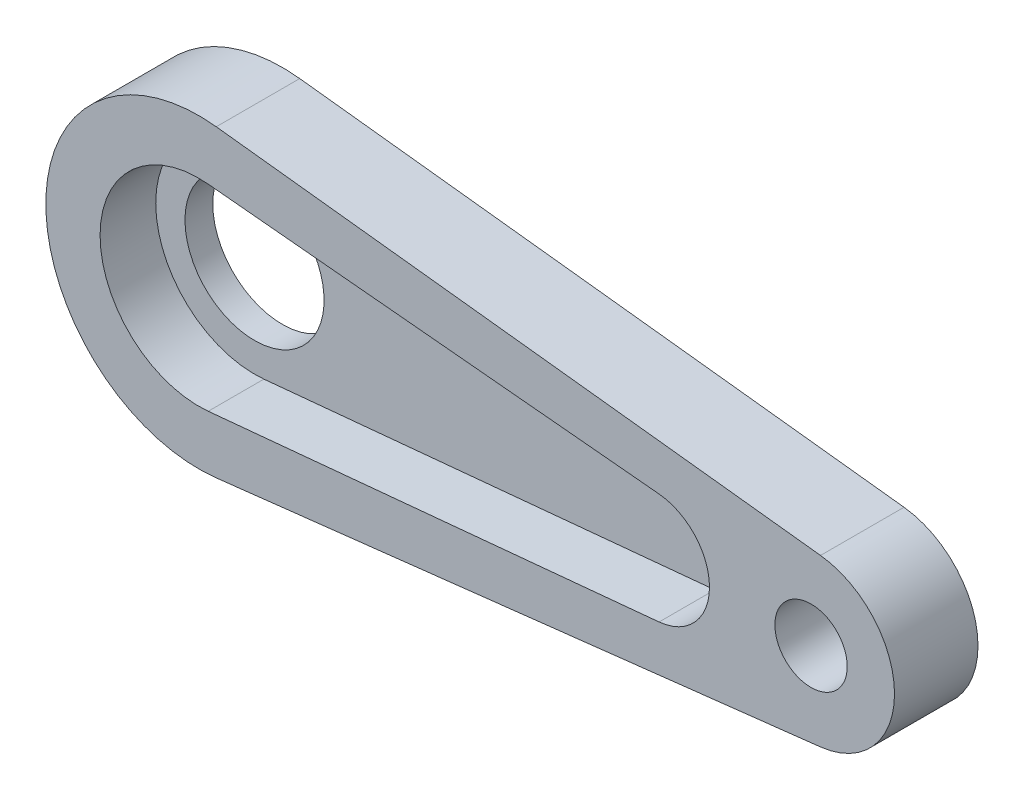
ISO-10303-21;
HEADER;
FILE_DESCRIPTION(('STEP AP214'),'2;1');
FILE_NAME('part.step','',(''),(''),'','','');
FILE_SCHEMA(('AUTOMOTIVE_DESIGN { 1 0 10303 214 1 1 1 1 }'));
ENDSEC;
DATA;
#1=APPLICATION_CONTEXT('core data for automotive mechanical design processes');
#2=APPLICATION_PROTOCOL_DEFINITION('international standard','automotive_design',2000,#1);
#3=PRODUCT_CONTEXT('',#1,'mechanical');
#4=PRODUCT('Part','Part','',(#3));
#5=PRODUCT_RELATED_PRODUCT_CATEGORY('part','',(#4));
#6=PRODUCT_DEFINITION_FORMATION('','',#4);
#7=PRODUCT_DEFINITION_CONTEXT('part definition',#1,'design');
#8=PRODUCT_DEFINITION('design','',#6,#7);
#9=PRODUCT_DEFINITION_SHAPE('','',#8);
#10=(LENGTH_UNIT() NAMED_UNIT(*) SI_UNIT(.MILLI.,.METRE.));
#11=(NAMED_UNIT(*) PLANE_ANGLE_UNIT() SI_UNIT($,.RADIAN.));
#12=(NAMED_UNIT(*) SI_UNIT($,.STERADIAN.) SOLID_ANGLE_UNIT());
#13=UNCERTAINTY_MEASURE_WITH_UNIT(LENGTH_MEASURE(1.E-05),#10,'distance_accuracy_value','');
#14=(GEOMETRIC_REPRESENTATION_CONTEXT(3) GLOBAL_UNCERTAINTY_ASSIGNED_CONTEXT((#13)) GLOBAL_UNIT_ASSIGNED_CONTEXT((#10,
#11,#12)) REPRESENTATION_CONTEXT('',''));
#15=CARTESIAN_POINT('',(0.,0.,0.));
#16=DIRECTION('',(0.,0.,1.));
#17=DIRECTION('',(1.,0.,0.));
#18=AXIS2_PLACEMENT_3D('',#15,#16,#17);
#19=CARTESIAN_POINT('',(0.,0.,2.));
#20=DIRECTION('',(0.,0.,-1.));
#21=DIRECTION('',(-1.,0.,0.));
#22=AXIS2_PLACEMENT_3D('',#19,#20,#21);
#23=PLANE('',#22);
#24=CARTESIAN_POINT('',(22.,0.,2.));
#25=DIRECTION('',(0.,0.,1.));
#26=DIRECTION('',(1.,0.,0.));
#27=AXIS2_PLACEMENT_3D('',#24,#25,#26);
#28=CIRCLE('',#27,1.3);
#29=CARTESIAN_POINT('',(23.3,0.,2.));
#30=VERTEX_POINT('',#29);
#31=EDGE_CURVE('E317',#30,#30,#28,.T.);
#32=ORIENTED_EDGE('',*,*,#31,.F.);
#33=EDGE_LOOP('',(#32));
#34=FACE_BOUND('',#33,.T.);
#35=CARTESIAN_POINT('',(0.,0.,2.));
#36=DIRECTION('',(0.,0.,1.));
#37=DIRECTION('',(-1.,0.,0.));
#38=AXIS2_PLACEMENT_3D('',#35,#36,#37);
#39=CIRCLE('',#38,5.5);
#40=CARTESIAN_POINT('',(0.625,5.4643732485986,2.));
#41=VERTEX_POINT('',#40);
#42=CARTESIAN_POINT('',(0.625,-5.4643732485986,2.));
#43=VERTEX_POINT('',#42);
#44=EDGE_CURVE('E103',#41,#43,#39,.T.);
#45=ORIENTED_EDGE('',*,*,#44,.T.);
#46=DIRECTION('',(0.993522408836109,0.113636363636364,0.));
#47=VECTOR('',#46,1.);
#48=CARTESIAN_POINT('',(0.625,-5.4643732485986,2.));
#49=LINE('',#48,#47);
#50=CARTESIAN_POINT('',(22.3409090909091,-2.98056722650833,2.));
#51=VERTEX_POINT('',#50);
#52=EDGE_CURVE('E159',#43,#51,#49,.T.);
#53=ORIENTED_EDGE('',*,*,#52,.T.);
#54=CARTESIAN_POINT('',(22.,0.,2.));
#55=DIRECTION('',(0.,0.,1.));
#56=DIRECTION('',(-1.,0.,0.));
#57=AXIS2_PLACEMENT_3D('',#54,#55,#56);
#58=CIRCLE('',#57,3.);
#59=CARTESIAN_POINT('',(22.3409090909091,2.98056722650833,2.));
#60=VERTEX_POINT('',#59);
#61=EDGE_CURVE('E161',#51,#60,#58,.T.);
#62=ORIENTED_EDGE('',*,*,#61,.T.);
#63=DIRECTION('',(-0.993522408836109,0.113636363636364,0.));
#64=VECTOR('',#63,1.);
#65=CARTESIAN_POINT('',(0.625,5.4643732485986,2.));
#66=LINE('',#65,#64);
#67=EDGE_CURVE('E56',#60,#41,#66,.T.);
#68=ORIENTED_EDGE('',*,*,#67,.T.);
#69=EDGE_LOOP('',(#45,#53,#62,#68));
#70=FACE_BOUND('',#69,.T.);
#71=CARTESIAN_POINT('',(0.,0.,2.));
#72=DIRECTION('',(0.,0.,1.));
#73=DIRECTION('',(1.,0.,0.));
#74=AXIS2_PLACEMENT_3D('',#71,#72,#73);
#75=CIRCLE('',#74,3.55);
#76=CARTESIAN_POINT('',(0.336544342507645,3.53401158819918,2.));
#77=VERTEX_POINT('',#76);
#78=CARTESIAN_POINT('',(0.336544342507645,-3.53401158819918,2.));
#79=VERTEX_POINT('',#78);
#80=EDGE_CURVE('E131',#77,#79,#75,.T.);
#81=ORIENTED_EDGE('',*,*,#80,.F.);
#82=DIRECTION('',(-0.995496222027938,0.0948012232415904,0.));
#83=VECTOR('',#82,1.);
#84=CARTESIAN_POINT('',(0.336544342507645,3.53401158819918,2.));
#85=LINE('',#84,#83);
#86=CARTESIAN_POINT('',(16.5396024464832,1.99099244405587,2.));
#87=VERTEX_POINT('',#86);
#88=EDGE_CURVE('E138',#87,#77,#85,.T.);
#89=ORIENTED_EDGE('',*,*,#88,.F.);
#90=CARTESIAN_POINT('',(16.35,0.,2.));
#91=DIRECTION('',(0.,0.,1.));
#92=DIRECTION('',(1.,0.,0.));
#93=AXIS2_PLACEMENT_3D('',#90,#91,#92);
#94=CIRCLE('',#93,2.);
#95=CARTESIAN_POINT('',(16.5396024464832,-1.99099244405587,2.));
#96=VERTEX_POINT('',#95);
#97=EDGE_CURVE('E136',#96,#87,#94,.T.);
#98=ORIENTED_EDGE('',*,*,#97,.F.);
#99=DIRECTION('',(0.995496222027938,0.0948012232415903,0.));
#100=VECTOR('',#99,1.);
#101=CARTESIAN_POINT('',(16.5396024464832,-1.99099244405587,2.));
#102=LINE('',#101,#100);
#103=EDGE_CURVE('E133',#79,#96,#102,.T.);
#104=ORIENTED_EDGE('',*,*,#103,.F.);
#105=EDGE_LOOP('',(#81,#89,#98,#104));
#106=FACE_BOUND('',#105,.T.);
#107=ADVANCED_FACE('F33',(#34,#70,#106),#23,.F.);
#108=CARTESIAN_POINT('',(0.,0.,2.));
#109=DIRECTION('',(0.,0.,-1.));
#110=DIRECTION('',(-1.,0.,0.));
#111=AXIS2_PLACEMENT_3D('',#108,#109,#110);
#112=CYLINDRICAL_SURFACE('',#111,5.5);
#113=DIRECTION('',(0.,0.,-1.));
#114=VECTOR('',#113,1.);
#115=CARTESIAN_POINT('',(0.625,5.4643732485986,2.));
#116=LINE('',#115,#114);
#117=CARTESIAN_POINT('',(0.625,5.4643732485986,-1.));
#118=VERTEX_POINT('',#117);
#119=EDGE_CURVE('E98',#41,#118,#116,.T.);
#120=ORIENTED_EDGE('',*,*,#119,.T.);
#121=CARTESIAN_POINT('',(0.,0.,-1.));
#122=DIRECTION('',(0.,0.,-1.));
#123=DIRECTION('',(-1.,0.,0.));
#124=AXIS2_PLACEMENT_3D('',#121,#122,#123);
#125=CIRCLE('',#124,5.5);
#126=CARTESIAN_POINT('',(0.625,-5.4643732485986,-1.));
#127=VERTEX_POINT('',#126);
#128=EDGE_CURVE('E102',#127,#118,#125,.T.);
#129=ORIENTED_EDGE('',*,*,#128,.F.);
#130=DIRECTION('',(0.,0.,-1.));
#131=VECTOR('',#130,1.);
#132=CARTESIAN_POINT('',(0.625,-5.4643732485986,2.));
#133=LINE('',#132,#131);
#134=EDGE_CURVE('E11',#43,#127,#133,.T.);
#135=ORIENTED_EDGE('',*,*,#134,.F.);
#136=ORIENTED_EDGE('',*,*,#44,.F.);
#137=EDGE_LOOP('',(#120,#129,#135,#136));
#138=FACE_BOUND('',#137,.T.);
#139=ADVANCED_FACE('F35',(#138),#112,.T.);
#140=CARTESIAN_POINT('',(0.625,-5.4643732485986,2.));
#141=DIRECTION('',(-0.113636363636364,0.993522408836109,0.));
#142=DIRECTION('',(-0.993522408836109,-0.113636363636364,0.));
#143=AXIS2_PLACEMENT_3D('',#140,#141,#142);
#144=PLANE('',#143);
#145=ORIENTED_EDGE('',*,*,#134,.T.);
#146=DIRECTION('',(-0.993522408836109,-0.113636363636364,0.));
#147=VECTOR('',#146,1.);
#148=CARTESIAN_POINT('',(0.625,-5.4643732485986,-1.));
#149=LINE('',#148,#147);
#150=CARTESIAN_POINT('',(22.3409090909091,-2.98056722650833,-1.));
#151=VERTEX_POINT('',#150);
#152=EDGE_CURVE('E120',#151,#127,#149,.T.);
#153=ORIENTED_EDGE('',*,*,#152,.F.);
#154=DIRECTION('',(0.,0.,-1.));
#155=VECTOR('',#154,1.);
#156=CARTESIAN_POINT('',(22.3409090909091,-2.98056722650833,2.));
#157=LINE('',#156,#155);
#158=EDGE_CURVE('E41',#51,#151,#157,.T.);
#159=ORIENTED_EDGE('',*,*,#158,.F.);
#160=ORIENTED_EDGE('',*,*,#52,.F.);
#161=EDGE_LOOP('',(#145,#153,#159,#160));
#162=FACE_BOUND('',#161,.T.);
#163=ADVANCED_FACE('F169',(#162),#144,.F.);
#164=CARTESIAN_POINT('',(22.,0.,2.));
#165=DIRECTION('',(0.,0.,-1.));
#166=DIRECTION('',(-1.,0.,0.));
#167=AXIS2_PLACEMENT_3D('',#164,#165,#166);
#168=CYLINDRICAL_SURFACE('',#167,3.);
#169=ORIENTED_EDGE('',*,*,#158,.T.);
#170=CARTESIAN_POINT('',(22.,0.,-1.));
#171=DIRECTION('',(0.,0.,-1.));
#172=DIRECTION('',(-1.,0.,0.));
#173=AXIS2_PLACEMENT_3D('',#170,#171,#172);
#174=CIRCLE('',#173,3.);
#175=CARTESIAN_POINT('',(22.3409090909091,2.98056722650833,-1.));
#176=VERTEX_POINT('',#175);
#177=EDGE_CURVE('E114',#176,#151,#174,.T.);
#178=ORIENTED_EDGE('',*,*,#177,.F.);
#179=DIRECTION('',(0.,0.,-1.));
#180=VECTOR('',#179,1.);
#181=CARTESIAN_POINT('',(22.3409090909091,2.98056722650833,2.));
#182=LINE('',#181,#180);
#183=EDGE_CURVE('E105',#60,#176,#182,.T.);
#184=ORIENTED_EDGE('',*,*,#183,.F.);
#185=ORIENTED_EDGE('',*,*,#61,.F.);
#186=EDGE_LOOP('',(#169,#178,#184,#185));
#187=FACE_BOUND('',#186,.T.);
#188=ADVANCED_FACE('F167',(#187),#168,.T.);
#189=CARTESIAN_POINT('',(0.625,5.4643732485986,2.));
#190=DIRECTION('',(-0.113636363636364,-0.993522408836109,0.));
#191=DIRECTION('',(0.993522408836109,-0.113636363636364,0.));
#192=AXIS2_PLACEMENT_3D('',#189,#190,#191);
#193=PLANE('',#192);
#194=ORIENTED_EDGE('',*,*,#183,.T.);
#195=DIRECTION('',(0.993522408836109,-0.113636363636364,0.));
#196=VECTOR('',#195,1.);
#197=CARTESIAN_POINT('',(0.625,5.4643732485986,-1.));
#198=LINE('',#197,#196);
#199=EDGE_CURVE('E108',#118,#176,#198,.T.);
#200=ORIENTED_EDGE('',*,*,#199,.F.);
#201=ORIENTED_EDGE('',*,*,#119,.F.);
#202=ORIENTED_EDGE('',*,*,#67,.F.);
#203=EDGE_LOOP('',(#194,#200,#201,#202));
#204=FACE_BOUND('',#203,.T.);
#205=ADVANCED_FACE('F109',(#204),#193,.F.);
#206=CARTESIAN_POINT('',(0.,0.,2.));
#207=DIRECTION('',(0.,0.,-1.));
#208=DIRECTION('',(-1.,0.,0.));
#209=AXIS2_PLACEMENT_3D('',#206,#207,#208);
#210=CYLINDRICAL_SURFACE('',#209,3.55);
#211=CARTESIAN_POINT('',(0.,0.,0.));
#212=DIRECTION('',(0.,0.,1.));
#213=DIRECTION('',(1.,0.,0.));
#214=AXIS2_PLACEMENT_3D('',#211,#212,#213);
#215=CIRCLE('',#214,3.55);
#216=CARTESIAN_POINT('',(0.336544342507645,3.53401158819918,0.));
#217=VERTEX_POINT('',#216);
#218=CARTESIAN_POINT('',(0.336544342507645,-3.53401158819918,0.));
#219=VERTEX_POINT('',#218);
#220=EDGE_CURVE('E130',#217,#219,#215,.T.);
#221=ORIENTED_EDGE('',*,*,#220,.F.);
#222=DIRECTION('',(0.,0.,-1.));
#223=VECTOR('',#222,1.);
#224=CARTESIAN_POINT('',(0.336544342507645,3.53401158819918,2.));
#225=LINE('',#224,#223);
#226=EDGE_CURVE('E140',#77,#217,#225,.T.);
#227=ORIENTED_EDGE('',*,*,#226,.F.);
#228=ORIENTED_EDGE('',*,*,#80,.T.);
#229=DIRECTION('',(0.,0.,-1.));
#230=VECTOR('',#229,1.);
#231=CARTESIAN_POINT('',(0.336544342507645,-3.53401158819918,2.));
#232=LINE('',#231,#230);
#233=EDGE_CURVE('E155',#79,#219,#232,.T.);
#234=ORIENTED_EDGE('',*,*,#233,.T.);
#235=EDGE_LOOP('',(#221,#227,#228,#234));
#236=FACE_BOUND('',#235,.T.);
#237=ADVANCED_FACE('F182',(#236),#210,.F.);
#238=CARTESIAN_POINT('',(16.5396024464832,-1.99099244405587,2.));
#239=DIRECTION('',(-0.0948012232415903,0.995496222027938,0.));
#240=DIRECTION('',(-0.995496222027938,-0.0948012232415903,0.));
#241=AXIS2_PLACEMENT_3D('',#238,#239,#240);
#242=PLANE('',#241);
#243=DIRECTION('',(0.995496222027938,0.0948012232415903,0.));
#244=VECTOR('',#243,1.);
#245=CARTESIAN_POINT('',(16.5396024464832,-1.99099244405587,0.));
#246=LINE('',#245,#244);
#247=CARTESIAN_POINT('',(16.5396024464832,-1.99099244405587,0.));
#248=VERTEX_POINT('',#247);
#249=EDGE_CURVE('E143',#219,#248,#246,.T.);
#250=ORIENTED_EDGE('',*,*,#249,.F.);
#251=ORIENTED_EDGE('',*,*,#233,.F.);
#252=ORIENTED_EDGE('',*,*,#103,.T.);
#253=DIRECTION('',(0.,0.,-1.));
#254=VECTOR('',#253,1.);
#255=CARTESIAN_POINT('',(16.5396024464832,-1.99099244405587,2.));
#256=LINE('',#255,#254);
#257=EDGE_CURVE('E153',#96,#248,#256,.T.);
#258=ORIENTED_EDGE('',*,*,#257,.T.);
#259=EDGE_LOOP('',(#250,#251,#252,#258));
#260=FACE_BOUND('',#259,.T.);
#261=ADVANCED_FACE('F184',(#260),#242,.T.);
#262=CARTESIAN_POINT('',(16.35,0.,2.));
#263=DIRECTION('',(0.,0.,-1.));
#264=DIRECTION('',(-1.,0.,0.));
#265=AXIS2_PLACEMENT_3D('',#262,#263,#264);
#266=CYLINDRICAL_SURFACE('',#265,2.);
#267=CARTESIAN_POINT('',(16.35,0.,0.));
#268=DIRECTION('',(0.,0.,1.));
#269=DIRECTION('',(1.,0.,0.));
#270=AXIS2_PLACEMENT_3D('',#267,#268,#269);
#271=CIRCLE('',#270,2.);
#272=CARTESIAN_POINT('',(16.5396024464832,1.99099244405587,0.));
#273=VERTEX_POINT('',#272);
#274=EDGE_CURVE('E146',#248,#273,#271,.T.);
#275=ORIENTED_EDGE('',*,*,#274,.F.);
#276=ORIENTED_EDGE('',*,*,#257,.F.);
#277=ORIENTED_EDGE('',*,*,#97,.T.);
#278=DIRECTION('',(0.,0.,-1.));
#279=VECTOR('',#278,1.);
#280=CARTESIAN_POINT('',(16.5396024464832,1.99099244405587,2.));
#281=LINE('',#280,#279);
#282=EDGE_CURVE('E48',#87,#273,#281,.T.);
#283=ORIENTED_EDGE('',*,*,#282,.T.);
#284=EDGE_LOOP('',(#275,#276,#277,#283));
#285=FACE_BOUND('',#284,.T.);
#286=ADVANCED_FACE('F192',(#285),#266,.F.);
#287=CARTESIAN_POINT('',(0.336544342507645,3.53401158819918,2.));
#288=DIRECTION('',(-0.0948012232415904,-0.995496222027938,0.));
#289=DIRECTION('',(0.995496222027938,-0.0948012232415904,0.));
#290=AXIS2_PLACEMENT_3D('',#287,#288,#289);
#291=PLANE('',#290);
#292=DIRECTION('',(-0.995496222027938,0.0948012232415904,0.));
#293=VECTOR('',#292,1.);
#294=CARTESIAN_POINT('',(0.336544342507645,3.53401158819918,0.));
#295=LINE('',#294,#293);
#296=EDGE_CURVE('E134',#273,#217,#295,.T.);
#297=ORIENTED_EDGE('',*,*,#296,.F.);
#298=ORIENTED_EDGE('',*,*,#282,.F.);
#299=ORIENTED_EDGE('',*,*,#88,.T.);
#300=ORIENTED_EDGE('',*,*,#226,.T.);
#301=EDGE_LOOP('',(#297,#298,#299,#300));
#302=FACE_BOUND('',#301,.T.);
#303=ADVANCED_FACE('F190',(#302),#291,.T.);
#304=CARTESIAN_POINT('',(0.,0.,-1.));
#305=DIRECTION('',(0.,0.,-1.));
#306=DIRECTION('',(-1.,0.,0.));
#307=AXIS2_PLACEMENT_3D('',#304,#305,#306);
#308=PLANE('',#307);
#309=CARTESIAN_POINT('',(22.,0.,-1.));
#310=DIRECTION('',(0.,0.,1.));
#311=DIRECTION('',(1.,0.,0.));
#312=AXIS2_PLACEMENT_3D('',#309,#310,#311);
#313=CIRCLE('',#312,1.3);
#314=CARTESIAN_POINT('',(23.3,0.,-1.));
#315=VERTEX_POINT('',#314);
#316=EDGE_CURVE('E315',#315,#315,#313,.T.);
#317=ORIENTED_EDGE('',*,*,#316,.T.);
#318=EDGE_LOOP('',(#317));
#319=FACE_BOUND('',#318,.T.);
#320=ORIENTED_EDGE('',*,*,#128,.T.);
#321=ORIENTED_EDGE('',*,*,#199,.T.);
#322=ORIENTED_EDGE('',*,*,#177,.T.);
#323=ORIENTED_EDGE('',*,*,#152,.T.);
#324=EDGE_LOOP('',(#320,#321,#322,#323));
#325=FACE_BOUND('',#324,.T.);
#326=CARTESIAN_POINT('',(0.,0.,-1.));
#327=DIRECTION('',(0.,0.,-1.));
#328=DIRECTION('',(-1.,0.,0.));
#329=AXIS2_PLACEMENT_3D('',#326,#327,#328);
#330=CIRCLE('',#329,2.5);
#331=CARTESIAN_POINT('',(-2.5,0.,-1.));
#332=VERTEX_POINT('',#331);
#333=EDGE_CURVE('E121',#332,#332,#330,.T.);
#334=ORIENTED_EDGE('',*,*,#333,.F.);
#335=EDGE_LOOP('',(#334));
#336=FACE_BOUND('',#335,.T.);
#337=ADVANCED_FACE('F117',(#319,#325,#336),#308,.T.);
#338=CARTESIAN_POINT('',(0.,0.,0.));
#339=DIRECTION('',(0.,0.,-1.));
#340=DIRECTION('',(-1.,0.,0.));
#341=AXIS2_PLACEMENT_3D('',#338,#339,#340);
#342=PLANE('',#341);
#343=ORIENTED_EDGE('',*,*,#220,.T.);
#344=ORIENTED_EDGE('',*,*,#249,.T.);
#345=ORIENTED_EDGE('',*,*,#274,.T.);
#346=ORIENTED_EDGE('',*,*,#296,.T.);
#347=EDGE_LOOP('',(#343,#344,#345,#346));
#348=FACE_BOUND('',#347,.T.);
#349=CARTESIAN_POINT('',(0.,0.,0.));
#350=DIRECTION('',(0.,0.,-1.));
#351=DIRECTION('',(-1.,0.,0.));
#352=AXIS2_PLACEMENT_3D('',#349,#350,#351);
#353=CIRCLE('',#352,2.5);
#354=CARTESIAN_POINT('',(-2.5,0.,0.));
#355=VERTEX_POINT('',#354);
#356=EDGE_CURVE('E124',#355,#355,#353,.T.);
#357=ORIENTED_EDGE('',*,*,#356,.T.);
#358=EDGE_LOOP('',(#357));
#359=FACE_BOUND('',#358,.T.);
#360=ADVANCED_FACE('F188',(#348,#359),#342,.F.);
#361=CARTESIAN_POINT('',(0.,0.,-1.));
#362=DIRECTION('',(0.,0.,1.));
#363=DIRECTION('',(1.,0.,0.));
#364=AXIS2_PLACEMENT_3D('',#361,#362,#363);
#365=CYLINDRICAL_SURFACE('',#364,2.5);
#366=ORIENTED_EDGE('',*,*,#333,.T.);
#367=EDGE_LOOP('',(#366));
#368=FACE_BOUND('',#367,.T.);
#369=ORIENTED_EDGE('',*,*,#356,.F.);
#370=EDGE_LOOP('',(#369));
#371=FACE_BOUND('',#370,.T.);
#372=ADVANCED_FACE('F229',(#368,#371),#365,.F.);
#373=CARTESIAN_POINT('',(22.,0.,-1.));
#374=DIRECTION('',(0.,0.,1.));
#375=DIRECTION('',(1.,0.,0.));
#376=AXIS2_PLACEMENT_3D('',#373,#374,#375);
#377=CYLINDRICAL_SURFACE('',#376,1.3);
#378=ORIENTED_EDGE('',*,*,#316,.F.);
#379=EDGE_LOOP('',(#378));
#380=FACE_BOUND('',#379,.T.);
#381=ORIENTED_EDGE('',*,*,#31,.T.);
#382=EDGE_LOOP('',(#381));
#383=FACE_BOUND('',#382,.T.);
#384=ADVANCED_FACE('F243',(#380,#383),#377,.F.);
#385=CLOSED_SHELL('',(#107,#139,#163,#188,#205,#237,#261,#286,#303,#337,#360,#372,#384));
#386=MANIFOLD_SOLID_BREP('B2',#385);
#387=ADVANCED_BREP_SHAPE_REPRESENTATION('',(#18,#386),#14);
#388=SHAPE_DEFINITION_REPRESENTATION(#9,#387);
ENDSEC;
END-ISO-10303-21;
